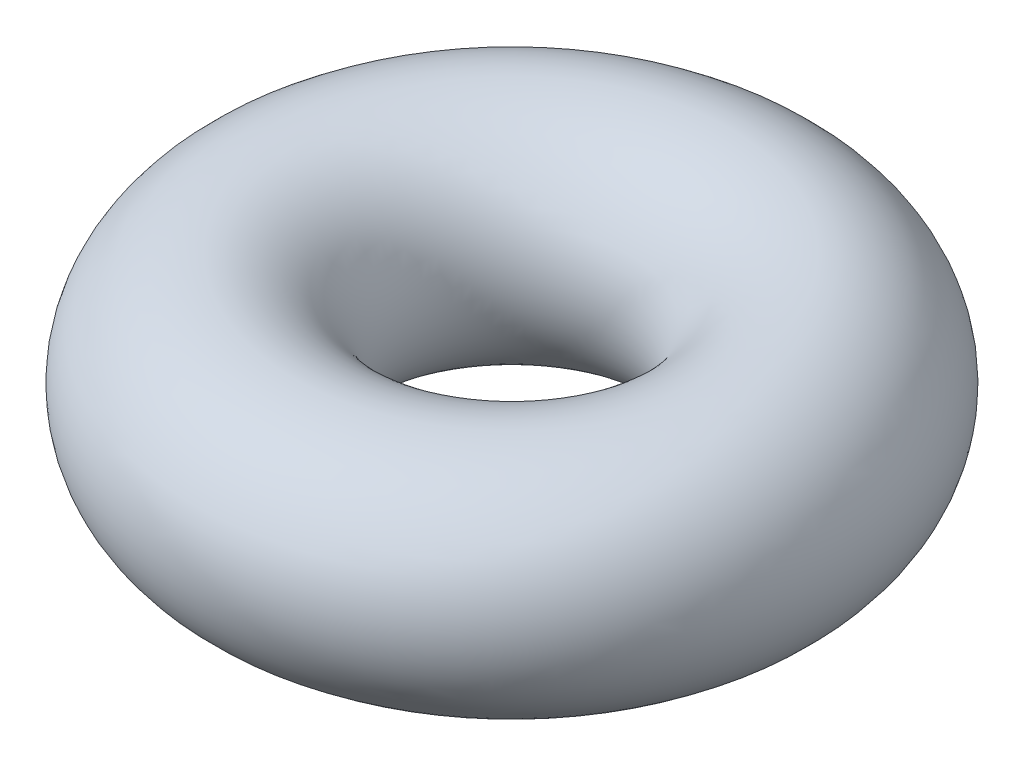
ISO-10303-21;
HEADER;
FILE_DESCRIPTION(('STEP AP214'),'2;1');
FILE_NAME('part.step','',(''),(''),'','','');
FILE_SCHEMA(('AUTOMOTIVE_DESIGN { 1 0 10303 214 1 1 1 1 }'));
ENDSEC;
DATA;
#1=APPLICATION_CONTEXT('core data for automotive mechanical design processes');
#2=APPLICATION_PROTOCOL_DEFINITION('international standard','automotive_design',2000,#1);
#3=PRODUCT_CONTEXT('',#1,'mechanical');
#4=PRODUCT('Part','Part','',(#3));
#5=PRODUCT_RELATED_PRODUCT_CATEGORY('part','',(#4));
#6=PRODUCT_DEFINITION_FORMATION('','',#4);
#7=PRODUCT_DEFINITION_CONTEXT('part definition',#1,'design');
#8=PRODUCT_DEFINITION('design','',#6,#7);
#9=PRODUCT_DEFINITION_SHAPE('','',#8);
#10=(LENGTH_UNIT() NAMED_UNIT(*) SI_UNIT(.MILLI.,.METRE.));
#11=(NAMED_UNIT(*) PLANE_ANGLE_UNIT() SI_UNIT($,.RADIAN.));
#12=(NAMED_UNIT(*) SI_UNIT($,.STERADIAN.) SOLID_ANGLE_UNIT());
#13=UNCERTAINTY_MEASURE_WITH_UNIT(LENGTH_MEASURE(1.E-05),#10,'distance_accuracy_value','');
#14=(GEOMETRIC_REPRESENTATION_CONTEXT(3) GLOBAL_UNCERTAINTY_ASSIGNED_CONTEXT((#13)) GLOBAL_UNIT_ASSIGNED_CONTEXT((#10,
#11,#12)) REPRESENTATION_CONTEXT('',''));
#15=CARTESIAN_POINT('',(0.,0.,0.));
#16=DIRECTION('',(0.,0.,1.));
#17=DIRECTION('',(1.,0.,0.));
#18=AXIS2_PLACEMENT_3D('',#15,#16,#17);
#19=CARTESIAN_POINT('',(0.,0.,0.));
#20=DIRECTION('',(0.,-1.,0.));
#21=DIRECTION('',(0.,0.,-1.));
#22=AXIS2_PLACEMENT_3D('',#19,#20,#21);
#23=TOROIDAL_SURFACE('',#22,1.4732,0.762);
#24=CARTESIAN_POINT('',(0.,0.,-2.2352));
#25=VERTEX_POINT('',#24);
#26=VERTEX_LOOP('',#25);
#27=FACE_BOUND('',#26,.T.);
#28=ADVANCED_FACE('F28',(#27),#23,.T.);
#29=CLOSED_SHELL('',(#28));
#30=MANIFOLD_SOLID_BREP('B2',#29);
#31=ADVANCED_BREP_SHAPE_REPRESENTATION('',(#18,#30),#14);
#32=SHAPE_DEFINITION_REPRESENTATION(#9,#31);
ENDSEC;
END-ISO-10303-21;
